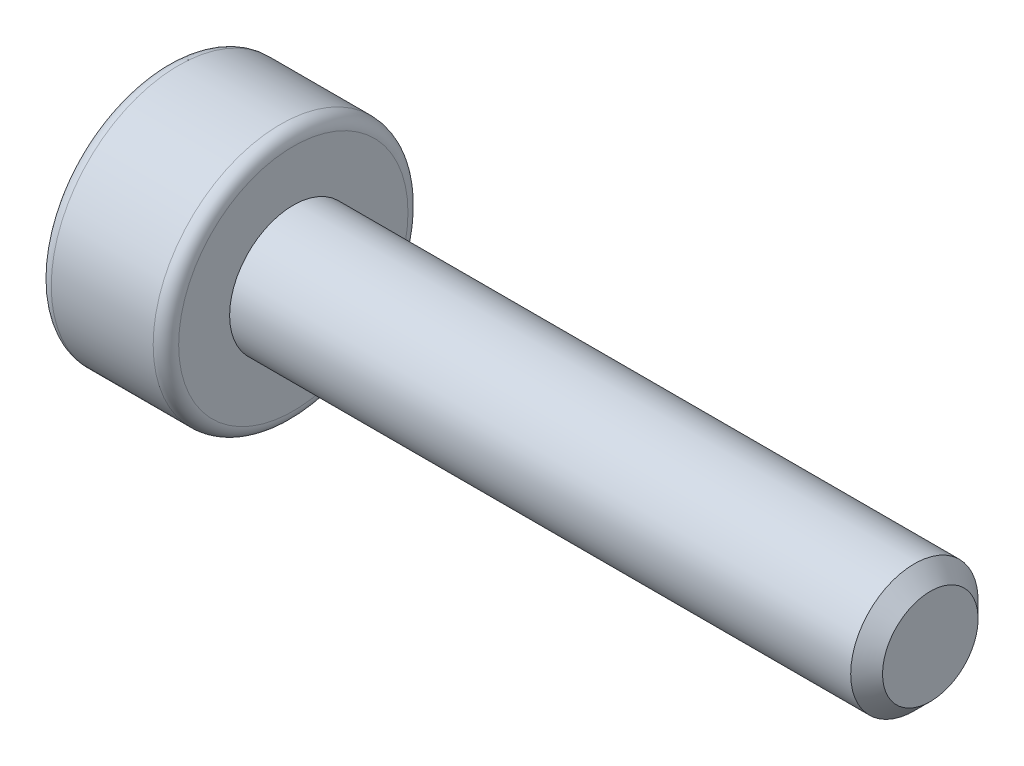
ISO-10303-21;
HEADER;
FILE_DESCRIPTION(('STEP AP214'),'2;1');
FILE_NAME('part.step','',(''),(''),'','','');
FILE_SCHEMA(('AUTOMOTIVE_DESIGN { 1 0 10303 214 1 1 1 1 }'));
ENDSEC;
DATA;
#1=APPLICATION_CONTEXT('core data for automotive mechanical design processes');
#2=APPLICATION_PROTOCOL_DEFINITION('international standard','automotive_design',2000,#1);
#3=PRODUCT_CONTEXT('',#1,'mechanical');
#4=PRODUCT('Part','Part','',(#3));
#5=PRODUCT_RELATED_PRODUCT_CATEGORY('part','',(#4));
#6=PRODUCT_DEFINITION_FORMATION('','',#4);
#7=PRODUCT_DEFINITION_CONTEXT('part definition',#1,'design');
#8=PRODUCT_DEFINITION('design','',#6,#7);
#9=PRODUCT_DEFINITION_SHAPE('','',#8);
#10=(LENGTH_UNIT() NAMED_UNIT(*) SI_UNIT(.MILLI.,.METRE.));
#11=(NAMED_UNIT(*) PLANE_ANGLE_UNIT() SI_UNIT($,.RADIAN.));
#12=(NAMED_UNIT(*) SI_UNIT($,.STERADIAN.) SOLID_ANGLE_UNIT());
#13=UNCERTAINTY_MEASURE_WITH_UNIT(LENGTH_MEASURE(1.E-05),#10,'distance_accuracy_value','');
#14=(GEOMETRIC_REPRESENTATION_CONTEXT(3) GLOBAL_UNCERTAINTY_ASSIGNED_CONTEXT((#13)) GLOBAL_UNIT_ASSIGNED_CONTEXT((#10,
#11,#12)) REPRESENTATION_CONTEXT('',''));
#15=CARTESIAN_POINT('',(0.,0.,0.));
#16=DIRECTION('',(0.,0.,1.));
#17=DIRECTION('',(1.,0.,0.));
#18=AXIS2_PLACEMENT_3D('',#15,#16,#17);
#19=CARTESIAN_POINT('',(0.,0.,0.));
#20=DIRECTION('',(1.,0.,0.));
#21=DIRECTION('',(0.,0.,-1.));
#22=AXIS2_PLACEMENT_3D('',#19,#20,#21);
#23=PLANE('',#22);
#24=DIRECTION('',(0.,0.866025403784439,0.5));
#25=VECTOR('',#24,1.);
#26=CARTESIAN_POINT('',(0.,-0.75,0.433012701892219));
#27=LINE('',#26,#25);
#28=CARTESIAN_POINT('',(0.,-0.75,0.433012701892219));
#29=VERTEX_POINT('',#28);
#30=CARTESIAN_POINT('',(0.,0.,0.866025403784438));
#31=VERTEX_POINT('',#30);
#32=EDGE_CURVE('E122',#29,#31,#27,.T.);
#33=ORIENTED_EDGE('',*,*,#32,.F.);
#34=DIRECTION('',(0.,0.,1.));
#35=VECTOR('',#34,1.);
#36=CARTESIAN_POINT('',(0.,-0.75,-0.43301270189222));
#37=LINE('',#36,#35);
#38=CARTESIAN_POINT('',(0.,-0.75,-0.43301270189222));
#39=VERTEX_POINT('',#38);
#40=EDGE_CURVE('E48',#39,#29,#37,.T.);
#41=ORIENTED_EDGE('',*,*,#40,.F.);
#42=DIRECTION('',(0.,-0.866025403784439,0.5));
#43=VECTOR('',#42,1.);
#44=CARTESIAN_POINT('',(0.,0.,-0.866025403784439));
#45=LINE('',#44,#43);
#46=CARTESIAN_POINT('',(0.,0.,-0.866025403784439));
#47=VERTEX_POINT('',#46);
#48=EDGE_CURVE('E131',#47,#39,#45,.T.);
#49=ORIENTED_EDGE('',*,*,#48,.F.);
#50=DIRECTION('',(0.,-0.866025403784439,-0.5));
#51=VECTOR('',#50,1.);
#52=CARTESIAN_POINT('',(0.,0.75,-0.43301270189222));
#53=LINE('',#52,#51);
#54=CARTESIAN_POINT('',(0.,0.75,-0.43301270189222));
#55=VERTEX_POINT('',#54);
#56=EDGE_CURVE('E129',#55,#47,#53,.T.);
#57=ORIENTED_EDGE('',*,*,#56,.F.);
#58=DIRECTION('',(0.,0.,-1.));
#59=VECTOR('',#58,1.);
#60=CARTESIAN_POINT('',(0.,0.75,0.433012701892219));
#61=LINE('',#60,#59);
#62=CARTESIAN_POINT('',(0.,0.75,0.433012701892219));
#63=VERTEX_POINT('',#62);
#64=EDGE_CURVE('E96',#63,#55,#61,.T.);
#65=ORIENTED_EDGE('',*,*,#64,.F.);
#66=DIRECTION('',(0.,0.866025403784439,-0.5));
#67=VECTOR('',#66,1.);
#68=CARTESIAN_POINT('',(0.,0.,0.866025403784438));
#69=LINE('',#68,#67);
#70=EDGE_CURVE('E125',#31,#63,#69,.T.);
#71=ORIENTED_EDGE('',*,*,#70,.F.);
#72=EDGE_LOOP('',(#33,#41,#49,#57,#65,#71));
#73=FACE_BOUND('',#72,.T.);
#74=CARTESIAN_POINT('',(0.,0.,0.));
#75=DIRECTION('',(-1.,0.,0.));
#76=DIRECTION('',(0.,0.,1.));
#77=AXIS2_PLACEMENT_3D('',#74,#75,#76);
#78=CIRCLE('',#77,1.8);
#79=CARTESIAN_POINT('',(0.,0.,1.8));
#80=VERTEX_POINT('',#79);
#81=EDGE_CURVE('E11',#80,#80,#78,.T.);
#82=ORIENTED_EDGE('',*,*,#81,.T.);
#83=EDGE_LOOP('',(#82));
#84=FACE_BOUND('',#83,.T.);
#85=ADVANCED_FACE('F34',(#73,#84),#23,.F.);
#86=CARTESIAN_POINT('',(0.2,0.,0.));
#87=DIRECTION('',(-1.,0.,0.));
#88=DIRECTION('',(0.,0.,1.));
#89=AXIS2_PLACEMENT_3D('',#86,#87,#88);
#90=TOROIDAL_SURFACE('',#89,1.8,0.2);
#91=ORIENTED_EDGE('',*,*,#81,.F.);
#92=EDGE_LOOP('',(#91));
#93=FACE_BOUND('',#92,.T.);
#94=CARTESIAN_POINT('',(0.200000000000001,0.,0.));
#95=DIRECTION('',(-1.,0.,0.));
#96=DIRECTION('',(0.,0.,1.));
#97=AXIS2_PLACEMENT_3D('',#94,#95,#96);
#98=CIRCLE('',#97,2.);
#99=CARTESIAN_POINT('',(0.200000000000001,0.,2.));
#100=VERTEX_POINT('',#99);
#101=EDGE_CURVE('E41',#100,#100,#98,.T.);
#102=ORIENTED_EDGE('',*,*,#101,.T.);
#103=EDGE_LOOP('',(#102));
#104=FACE_BOUND('',#103,.T.);
#105=ADVANCED_FACE('F157',(#93,#104),#90,.T.);
#106=CARTESIAN_POINT('',(-2.28184155946539,0.,0.));
#107=DIRECTION('',(-1.,0.,0.));
#108=DIRECTION('',(0.,0.,1.));
#109=AXIS2_PLACEMENT_3D('',#106,#107,#108);
#110=CYLINDRICAL_SURFACE('',#109,2.);
#111=ORIENTED_EDGE('',*,*,#101,.F.);
#112=EDGE_LOOP('',(#111));
#113=FACE_BOUND('',#112,.T.);
#114=CARTESIAN_POINT('',(1.8,0.,0.));
#115=DIRECTION('',(-1.,0.,0.));
#116=DIRECTION('',(0.,0.,1.));
#117=AXIS2_PLACEMENT_3D('',#114,#115,#116);
#118=CIRCLE('',#117,2.);
#119=CARTESIAN_POINT('',(1.8,0.,2.));
#120=VERTEX_POINT('',#119);
#121=EDGE_CURVE('E152',#120,#120,#118,.T.);
#122=ORIENTED_EDGE('',*,*,#121,.T.);
#123=EDGE_LOOP('',(#122));
#124=FACE_BOUND('',#123,.T.);
#125=ADVANCED_FACE('F159',(#113,#124),#110,.T.);
#126=CARTESIAN_POINT('',(1.8,0.,0.));
#127=DIRECTION('',(-1.,0.,0.));
#128=DIRECTION('',(0.,0.,1.));
#129=AXIS2_PLACEMENT_3D('',#126,#127,#128);
#130=TOROIDAL_SURFACE('',#129,1.8,0.2);
#131=ORIENTED_EDGE('',*,*,#121,.F.);
#132=EDGE_LOOP('',(#131));
#133=FACE_BOUND('',#132,.T.);
#134=CARTESIAN_POINT('',(2.,0.,0.));
#135=DIRECTION('',(-1.,0.,0.));
#136=DIRECTION('',(0.,0.,1.));
#137=AXIS2_PLACEMENT_3D('',#134,#135,#136);
#138=CIRCLE('',#137,1.8);
#139=CARTESIAN_POINT('',(2.,0.,1.8));
#140=VERTEX_POINT('',#139);
#141=EDGE_CURVE('E149',#140,#140,#138,.T.);
#142=ORIENTED_EDGE('',*,*,#141,.T.);
#143=EDGE_LOOP('',(#142));
#144=FACE_BOUND('',#143,.T.);
#145=ADVANCED_FACE('F162',(#133,#144),#130,.T.);
#146=CARTESIAN_POINT('',(2.,1.,0.));
#147=DIRECTION('',(-1.,0.,0.));
#148=DIRECTION('',(0.,0.,1.));
#149=AXIS2_PLACEMENT_3D('',#146,#147,#148);
#150=PLANE('',#149);
#151=ORIENTED_EDGE('',*,*,#141,.F.);
#152=EDGE_LOOP('',(#151));
#153=FACE_BOUND('',#152,.T.);
#154=CARTESIAN_POINT('',(2.,0.,0.));
#155=DIRECTION('',(-1.,0.,0.));
#156=DIRECTION('',(0.,0.,1.));
#157=AXIS2_PLACEMENT_3D('',#154,#155,#156);
#158=CIRCLE('',#157,1.);
#159=CARTESIAN_POINT('',(2.,0.,1.));
#160=VERTEX_POINT('',#159);
#161=EDGE_CURVE('E146',#160,#160,#158,.T.);
#162=ORIENTED_EDGE('',*,*,#161,.T.);
#163=EDGE_LOOP('',(#162));
#164=FACE_BOUND('',#163,.T.);
#165=ADVANCED_FACE('F168',(#153,#164),#150,.F.);
#166=CARTESIAN_POINT('',(-2.28184155946539,0.,0.));
#167=DIRECTION('',(-1.,0.,0.));
#168=DIRECTION('',(0.,0.,1.));
#169=AXIS2_PLACEMENT_3D('',#166,#167,#168);
#170=CYLINDRICAL_SURFACE('',#169,1.);
#171=ORIENTED_EDGE('',*,*,#161,.F.);
#172=EDGE_LOOP('',(#171));
#173=FACE_BOUND('',#172,.T.);
#174=CARTESIAN_POINT('',(11.75,0.,0.));
#175=DIRECTION('',(-1.,0.,0.));
#176=DIRECTION('',(0.,0.,1.));
#177=AXIS2_PLACEMENT_3D('',#174,#175,#176);
#178=CIRCLE('',#177,1.);
#179=CARTESIAN_POINT('',(11.75,0.,1.));
#180=VERTEX_POINT('',#179);
#181=EDGE_CURVE('E143',#180,#180,#178,.T.);
#182=ORIENTED_EDGE('',*,*,#181,.T.);
#183=EDGE_LOOP('',(#182));
#184=FACE_BOUND('',#183,.T.);
#185=ADVANCED_FACE('F174',(#173,#184),#170,.T.);
#186=CARTESIAN_POINT('',(12.,0.,0.));
#187=DIRECTION('',(-1.,0.,0.));
#188=DIRECTION('',(0.,0.,1.));
#189=AXIS2_PLACEMENT_3D('',#186,#187,#188);
#190=CONICAL_SURFACE('',#189,0.75,0.785398163397451);
#191=ORIENTED_EDGE('',*,*,#181,.F.);
#192=EDGE_LOOP('',(#191));
#193=FACE_BOUND('',#192,.T.);
#194=CARTESIAN_POINT('',(12.,0.,0.));
#195=DIRECTION('',(-1.,0.,0.));
#196=DIRECTION('',(0.,0.,1.));
#197=AXIS2_PLACEMENT_3D('',#194,#195,#196);
#198=CIRCLE('',#197,0.75);
#199=CARTESIAN_POINT('',(12.,0.,0.75));
#200=VERTEX_POINT('',#199);
#201=EDGE_CURVE('E135',#200,#200,#198,.T.);
#202=ORIENTED_EDGE('',*,*,#201,.T.);
#203=EDGE_LOOP('',(#202));
#204=FACE_BOUND('',#203,.T.);
#205=ADVANCED_FACE('F180',(#193,#204),#190,.T.);
#206=CARTESIAN_POINT('',(12.,0.75,0.));
#207=DIRECTION('',(-1.,0.,0.));
#208=DIRECTION('',(0.,0.,1.));
#209=AXIS2_PLACEMENT_3D('',#206,#207,#208);
#210=PLANE('',#209);
#211=ORIENTED_EDGE('',*,*,#201,.F.);
#212=EDGE_LOOP('',(#211));
#213=FACE_BOUND('',#212,.T.);
#214=ADVANCED_FACE('F186',(#213),#210,.F.);
#215=CARTESIAN_POINT('',(0.8,-0.75,-0.43301270189222));
#216=DIRECTION('',(0.,-1.,0.));
#217=DIRECTION('',(0.,0.,-1.));
#218=AXIS2_PLACEMENT_3D('',#215,#216,#217);
#219=PLANE('',#218);
#220=ORIENTED_EDGE('',*,*,#40,.T.);
#221=DIRECTION('',(-1.,0.,0.));
#222=VECTOR('',#221,1.);
#223=CARTESIAN_POINT('',(0.8,-0.75,0.433012701892219));
#224=LINE('',#223,#222);
#225=CARTESIAN_POINT('',(0.8,-0.75,0.433012701892219));
#226=VERTEX_POINT('',#225);
#227=EDGE_CURVE('E78',#226,#29,#224,.T.);
#228=ORIENTED_EDGE('',*,*,#227,.F.);
#229=DIRECTION('',(0.,0.,1.));
#230=VECTOR('',#229,1.);
#231=CARTESIAN_POINT('',(0.8,-0.75,-0.43301270189222));
#232=LINE('',#231,#230);
#233=CARTESIAN_POINT('',(0.8,-0.75,-0.43301270189222));
#234=VERTEX_POINT('',#233);
#235=EDGE_CURVE('E133',#234,#226,#232,.T.);
#236=ORIENTED_EDGE('',*,*,#235,.F.);
#237=DIRECTION('',(-1.,0.,0.));
#238=VECTOR('',#237,1.);
#239=CARTESIAN_POINT('',(0.8,-0.75,-0.43301270189222));
#240=LINE('',#239,#238);
#241=EDGE_CURVE('E56',#234,#39,#240,.T.);
#242=ORIENTED_EDGE('',*,*,#241,.T.);
#243=EDGE_LOOP('',(#220,#228,#236,#242));
#244=FACE_BOUND('',#243,.T.);
#245=ADVANCED_FACE('F191',(#244),#219,.F.);
#246=CARTESIAN_POINT('',(0.8,0.,-0.866025403784439));
#247=DIRECTION('',(0.,-0.5,-0.866025403784439));
#248=DIRECTION('',(0.,0.866025403784439,-0.5));
#249=AXIS2_PLACEMENT_3D('',#246,#247,#248);
#250=PLANE('',#249);
#251=ORIENTED_EDGE('',*,*,#48,.T.);
#252=ORIENTED_EDGE('',*,*,#241,.F.);
#253=DIRECTION('',(0.,-0.866025403784439,0.5));
#254=VECTOR('',#253,1.);
#255=CARTESIAN_POINT('',(0.8,0.,-0.866025403784439));
#256=LINE('',#255,#254);
#257=CARTESIAN_POINT('',(0.8,0.,-0.866025403784439));
#258=VERTEX_POINT('',#257);
#259=EDGE_CURVE('E108',#258,#234,#256,.T.);
#260=ORIENTED_EDGE('',*,*,#259,.F.);
#261=DIRECTION('',(-1.,0.,0.));
#262=VECTOR('',#261,1.);
#263=CARTESIAN_POINT('',(0.8,0.,-0.866025403784439));
#264=LINE('',#263,#262);
#265=EDGE_CURVE('E100',#258,#47,#264,.T.);
#266=ORIENTED_EDGE('',*,*,#265,.T.);
#267=EDGE_LOOP('',(#251,#252,#260,#266));
#268=FACE_BOUND('',#267,.T.);
#269=ADVANCED_FACE('F196',(#268),#250,.F.);
#270=CARTESIAN_POINT('',(0.8,0.75,-0.43301270189222));
#271=DIRECTION('',(0.,0.5,-0.866025403784439));
#272=DIRECTION('',(0.,0.866025403784439,0.5));
#273=AXIS2_PLACEMENT_3D('',#270,#271,#272);
#274=PLANE('',#273);
#275=ORIENTED_EDGE('',*,*,#56,.T.);
#276=ORIENTED_EDGE('',*,*,#265,.F.);
#277=DIRECTION('',(0.,-0.866025403784439,-0.5));
#278=VECTOR('',#277,1.);
#279=CARTESIAN_POINT('',(0.8,0.75,-0.43301270189222));
#280=LINE('',#279,#278);
#281=CARTESIAN_POINT('',(0.8,0.75,-0.43301270189222));
#282=VERTEX_POINT('',#281);
#283=EDGE_CURVE('E104',#282,#258,#280,.T.);
#284=ORIENTED_EDGE('',*,*,#283,.F.);
#285=DIRECTION('',(-1.,0.,0.));
#286=VECTOR('',#285,1.);
#287=CARTESIAN_POINT('',(0.8,0.75,-0.43301270189222));
#288=LINE('',#287,#286);
#289=EDGE_CURVE('E89',#282,#55,#288,.T.);
#290=ORIENTED_EDGE('',*,*,#289,.T.);
#291=EDGE_LOOP('',(#275,#276,#284,#290));
#292=FACE_BOUND('',#291,.T.);
#293=ADVANCED_FACE('F105',(#292),#274,.F.);
#294=CARTESIAN_POINT('',(0.8,0.75,0.433012701892219));
#295=DIRECTION('',(0.,1.,0.));
#296=DIRECTION('',(0.,0.,1.));
#297=AXIS2_PLACEMENT_3D('',#294,#295,#296);
#298=PLANE('',#297);
#299=ORIENTED_EDGE('',*,*,#64,.T.);
#300=ORIENTED_EDGE('',*,*,#289,.F.);
#301=DIRECTION('',(0.,0.,-1.));
#302=VECTOR('',#301,1.);
#303=CARTESIAN_POINT('',(0.8,0.75,0.433012701892219));
#304=LINE('',#303,#302);
#305=CARTESIAN_POINT('',(0.8,0.75,0.433012701892219));
#306=VERTEX_POINT('',#305);
#307=EDGE_CURVE('E93',#306,#282,#304,.T.);
#308=ORIENTED_EDGE('',*,*,#307,.F.);
#309=DIRECTION('',(-1.,0.,0.));
#310=VECTOR('',#309,1.);
#311=CARTESIAN_POINT('',(0.8,0.75,0.433012701892219));
#312=LINE('',#311,#310);
#313=EDGE_CURVE('E101',#306,#63,#312,.T.);
#314=ORIENTED_EDGE('',*,*,#313,.T.);
#315=EDGE_LOOP('',(#299,#300,#308,#314));
#316=FACE_BOUND('',#315,.T.);
#317=ADVANCED_FACE('F91',(#316),#298,.F.);
#318=CARTESIAN_POINT('',(0.8,0.,0.866025403784438));
#319=DIRECTION('',(0.,0.5,0.866025403784439));
#320=DIRECTION('',(0.,-0.866025403784439,0.5));
#321=AXIS2_PLACEMENT_3D('',#318,#319,#320);
#322=PLANE('',#321);
#323=ORIENTED_EDGE('',*,*,#70,.T.);
#324=ORIENTED_EDGE('',*,*,#313,.F.);
#325=DIRECTION('',(0.,0.866025403784439,-0.5));
#326=VECTOR('',#325,1.);
#327=CARTESIAN_POINT('',(0.8,0.,0.866025403784438));
#328=LINE('',#327,#326);
#329=CARTESIAN_POINT('',(0.8,0.,0.866025403784438));
#330=VERTEX_POINT('',#329);
#331=EDGE_CURVE('E114',#330,#306,#328,.T.);
#332=ORIENTED_EDGE('',*,*,#331,.F.);
#333=DIRECTION('',(-1.,0.,0.));
#334=VECTOR('',#333,1.);
#335=CARTESIAN_POINT('',(0.8,0.,0.866025403784438));
#336=LINE('',#335,#334);
#337=EDGE_CURVE('E138',#330,#31,#336,.T.);
#338=ORIENTED_EDGE('',*,*,#337,.T.);
#339=EDGE_LOOP('',(#323,#324,#332,#338));
#340=FACE_BOUND('',#339,.T.);
#341=ADVANCED_FACE('F222',(#340),#322,.F.);
#342=CARTESIAN_POINT('',(0.8,-0.75,0.433012701892219));
#343=DIRECTION('',(0.,-0.5,0.866025403784439));
#344=DIRECTION('',(0.,-0.866025403784439,-0.5));
#345=AXIS2_PLACEMENT_3D('',#342,#343,#344);
#346=PLANE('',#345);
#347=ORIENTED_EDGE('',*,*,#32,.T.);
#348=ORIENTED_EDGE('',*,*,#337,.F.);
#349=DIRECTION('',(0.,0.866025403784439,0.5));
#350=VECTOR('',#349,1.);
#351=CARTESIAN_POINT('',(0.8,-0.75,0.433012701892219));
#352=LINE('',#351,#350);
#353=EDGE_CURVE('E116',#226,#330,#352,.T.);
#354=ORIENTED_EDGE('',*,*,#353,.F.);
#355=ORIENTED_EDGE('',*,*,#227,.T.);
#356=EDGE_LOOP('',(#347,#348,#354,#355));
#357=FACE_BOUND('',#356,.T.);
#358=ADVANCED_FACE('F210',(#357),#346,.F.);
#359=CARTESIAN_POINT('',(0.8,0.,0.));
#360=DIRECTION('',(-1.,0.,0.));
#361=DIRECTION('',(0.,0.,1.));
#362=AXIS2_PLACEMENT_3D('',#359,#360,#361);
#363=PLANE('',#362);
#364=ORIENTED_EDGE('',*,*,#235,.T.);
#365=ORIENTED_EDGE('',*,*,#353,.T.);
#366=ORIENTED_EDGE('',*,*,#331,.T.);
#367=ORIENTED_EDGE('',*,*,#307,.T.);
#368=ORIENTED_EDGE('',*,*,#283,.T.);
#369=ORIENTED_EDGE('',*,*,#259,.T.);
#370=EDGE_LOOP('',(#364,#365,#366,#367,#368,#369));
#371=FACE_BOUND('',#370,.T.);
#372=ADVANCED_FACE('F111',(#371),#363,.T.);
#373=CLOSED_SHELL('',(#85,#105,#125,#145,#165,#185,#205,#214,#245,#269,#293,#317,#341,#358,#372));
#374=MANIFOLD_SOLID_BREP('B2',#373);
#375=ADVANCED_BREP_SHAPE_REPRESENTATION('',(#18,#374),#14);
#376=SHAPE_DEFINITION_REPRESENTATION(#9,#375);
ENDSEC;
END-ISO-10303-21;
